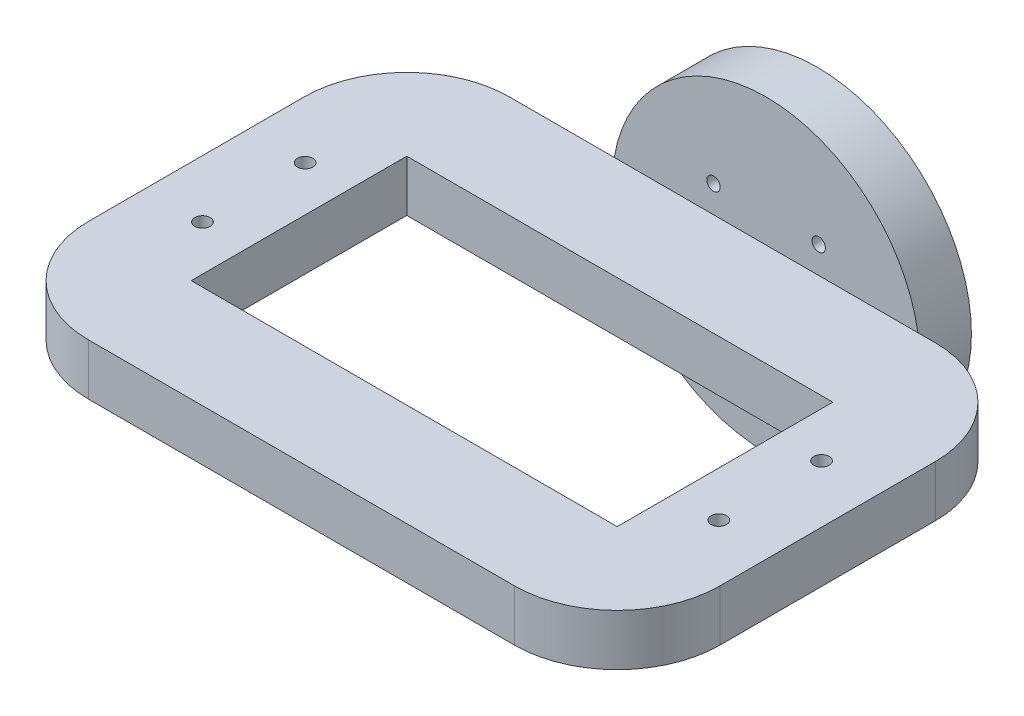
ISO-10303-21;
HEADER;
FILE_DESCRIPTION(('STEP AP214'),'2;1');
FILE_NAME('part.step','',(''),(''),'','','');
FILE_SCHEMA(('AUTOMOTIVE_DESIGN { 1 0 10303 214 1 1 1 1 }'));
ENDSEC;
DATA;
#1=APPLICATION_CONTEXT('core data for automotive mechanical design processes');
#2=APPLICATION_PROTOCOL_DEFINITION('international standard','automotive_design',2000,#1);
#3=PRODUCT_CONTEXT('',#1,'mechanical');
#4=PRODUCT('Part','Part','',(#3));
#5=PRODUCT_RELATED_PRODUCT_CATEGORY('part','',(#4));
#6=PRODUCT_DEFINITION_FORMATION('','',#4);
#7=PRODUCT_DEFINITION_CONTEXT('part definition',#1,'design');
#8=PRODUCT_DEFINITION('design','',#6,#7);
#9=PRODUCT_DEFINITION_SHAPE('','',#8);
#10=(LENGTH_UNIT() NAMED_UNIT(*) SI_UNIT(.MILLI.,.METRE.));
#11=(NAMED_UNIT(*) PLANE_ANGLE_UNIT() SI_UNIT($,.RADIAN.));
#12=(NAMED_UNIT(*) SI_UNIT($,.STERADIAN.) SOLID_ANGLE_UNIT());
#13=UNCERTAINTY_MEASURE_WITH_UNIT(LENGTH_MEASURE(1.E-05),#10,'distance_accuracy_value','');
#14=(GEOMETRIC_REPRESENTATION_CONTEXT(3) GLOBAL_UNCERTAINTY_ASSIGNED_CONTEXT((#13)) GLOBAL_UNIT_ASSIGNED_CONTEXT((#10,
#11,#12)) REPRESENTATION_CONTEXT('',''));
#15=CARTESIAN_POINT('',(0.,0.,0.));
#16=DIRECTION('',(0.,0.,1.));
#17=DIRECTION('',(1.,0.,0.));
#18=AXIS2_PLACEMENT_3D('',#15,#16,#17);
#19=CARTESIAN_POINT('',(-10.,0.,36.));
#20=DIRECTION('',(0.,-1.,0.));
#21=DIRECTION('',(1.,0.,0.));
#22=AXIS2_PLACEMENT_3D('',#19,#20,#21);
#23=CYLINDRICAL_SURFACE('',#22,10.);
#24=DIRECTION('',(0.,1.,0.));
#25=VECTOR('',#24,1.);
#26=CARTESIAN_POINT('',(-10.,0.,46.));
#27=LINE('',#26,#25);
#28=CARTESIAN_POINT('',(-10.,12.5,46.));
#29=VERTEX_POINT('',#28);
#30=CARTESIAN_POINT('',(-10.,17.5,46.));
#31=VERTEX_POINT('',#30);
#32=EDGE_CURVE('E240',#29,#31,#27,.T.);
#33=ORIENTED_EDGE('',*,*,#32,.F.);
#34=CARTESIAN_POINT('',(-10.,12.5,36.));
#35=DIRECTION('',(0.,1.,0.));
#36=DIRECTION('',(0.,0.,1.));
#37=AXIS2_PLACEMENT_3D('',#34,#35,#36);
#38=CIRCLE('',#37,10.);
#39=CARTESIAN_POINT('',(0.,12.5,36.));
#40=VERTEX_POINT('',#39);
#41=EDGE_CURVE('E48',#40,#29,#38,.F.);
#42=ORIENTED_EDGE('',*,*,#41,.F.);
#43=DIRECTION('',(0.,1.,0.));
#44=VECTOR('',#43,1.);
#45=CARTESIAN_POINT('',(0.,0.,36.));
#46=LINE('',#45,#44);
#47=CARTESIAN_POINT('',(0.,17.5,36.));
#48=VERTEX_POINT('',#47);
#49=EDGE_CURVE('E244',#48,#40,#46,.F.);
#50=ORIENTED_EDGE('',*,*,#49,.F.);
#51=CARTESIAN_POINT('',(-10.,17.5,36.));
#52=DIRECTION('',(0.,-1.,0.));
#53=DIRECTION('',(0.,0.,-1.));
#54=AXIS2_PLACEMENT_3D('',#51,#52,#53);
#55=CIRCLE('',#54,10.);
#56=EDGE_CURVE('E12',#31,#48,#55,.F.);
#57=ORIENTED_EDGE('',*,*,#56,.F.);
#58=EDGE_LOOP('',(#33,#42,#50,#57));
#59=FACE_BOUND('',#58,.T.);
#60=ADVANCED_FACE('F40',(#59),#23,.T.);
#61=CARTESIAN_POINT('',(-10.,15.,15.));
#62=DIRECTION('',(0.,1.,0.));
#63=DIRECTION('',(-1.,0.,0.));
#64=AXIS2_PLACEMENT_3D('',#61,#62,#63);
#65=CYLINDRICAL_SURFACE('',#64,10.);
#66=DIRECTION('',(0.,-1.,0.));
#67=VECTOR('',#66,1.);
#68=CARTESIAN_POINT('',(-10.,15.,5.));
#69=LINE('',#68,#67);
#70=CARTESIAN_POINT('',(-10.,17.5,5.));
#71=VERTEX_POINT('',#70);
#72=CARTESIAN_POINT('',(-10.,12.5,5.));
#73=VERTEX_POINT('',#72);
#74=EDGE_CURVE('E225',#71,#73,#69,.T.);
#75=ORIENTED_EDGE('',*,*,#74,.F.);
#76=CARTESIAN_POINT('',(-10.,17.5,15.));
#77=DIRECTION('',(0.,-1.,0.));
#78=DIRECTION('',(0.,0.,-1.));
#79=AXIS2_PLACEMENT_3D('',#76,#77,#78);
#80=CIRCLE('',#79,10.);
#81=CARTESIAN_POINT('',(0.,17.5,15.));
#82=VERTEX_POINT('',#81);
#83=EDGE_CURVE('E233',#82,#71,#80,.F.);
#84=ORIENTED_EDGE('',*,*,#83,.F.);
#85=DIRECTION('',(0.,-1.,0.));
#86=VECTOR('',#85,1.);
#87=CARTESIAN_POINT('',(0.,15.,15.));
#88=LINE('',#87,#86);
#89=CARTESIAN_POINT('',(0.,12.5,15.));
#90=VERTEX_POINT('',#89);
#91=EDGE_CURVE('E229',#90,#82,#88,.F.);
#92=ORIENTED_EDGE('',*,*,#91,.F.);
#93=CARTESIAN_POINT('',(-10.,12.5,15.));
#94=DIRECTION('',(0.,1.,0.));
#95=DIRECTION('',(0.,0.,1.));
#96=AXIS2_PLACEMENT_3D('',#93,#94,#95);
#97=CIRCLE('',#96,10.);
#98=EDGE_CURVE('E236',#73,#90,#97,.F.);
#99=ORIENTED_EDGE('',*,*,#98,.F.);
#100=EDGE_LOOP('',(#75,#84,#92,#99));
#101=FACE_BOUND('',#100,.T.);
#102=ADVANCED_FACE('F414',(#101),#65,.T.);
#103=CARTESIAN_POINT('',(-51.5,0.,36.));
#104=DIRECTION('',(0.,-1.,0.));
#105=DIRECTION('',(0.,0.,-1.));
#106=AXIS2_PLACEMENT_3D('',#103,#104,#105);
#107=CYLINDRICAL_SURFACE('',#106,10.);
#108=DIRECTION('',(0.,1.,0.));
#109=VECTOR('',#108,1.);
#110=CARTESIAN_POINT('',(-61.5,0.,36.));
#111=LINE('',#110,#109);
#112=CARTESIAN_POINT('',(-61.5,12.5,36.));
#113=VERTEX_POINT('',#112);
#114=CARTESIAN_POINT('',(-61.5,17.5,36.));
#115=VERTEX_POINT('',#114);
#116=EDGE_CURVE('E210',#113,#115,#111,.T.);
#117=ORIENTED_EDGE('',*,*,#116,.F.);
#118=CARTESIAN_POINT('',(-51.5,12.5,36.));
#119=DIRECTION('',(0.,1.,0.));
#120=DIRECTION('',(0.,0.,1.));
#121=AXIS2_PLACEMENT_3D('',#118,#119,#120);
#122=CIRCLE('',#121,10.);
#123=CARTESIAN_POINT('',(-51.5,12.5,46.));
#124=VERTEX_POINT('',#123);
#125=EDGE_CURVE('E218',#124,#113,#122,.F.);
#126=ORIENTED_EDGE('',*,*,#125,.F.);
#127=DIRECTION('',(0.,1.,0.));
#128=VECTOR('',#127,1.);
#129=CARTESIAN_POINT('',(-51.5,0.,46.));
#130=LINE('',#129,#128);
#131=CARTESIAN_POINT('',(-51.5,17.5,46.));
#132=VERTEX_POINT('',#131);
#133=EDGE_CURVE('E214',#132,#124,#130,.F.);
#134=ORIENTED_EDGE('',*,*,#133,.F.);
#135=CARTESIAN_POINT('',(-51.5,17.5,36.));
#136=DIRECTION('',(0.,-1.,0.));
#137=DIRECTION('',(0.,0.,-1.));
#138=AXIS2_PLACEMENT_3D('',#135,#136,#137);
#139=CIRCLE('',#138,10.);
#140=EDGE_CURVE('E221',#115,#132,#139,.F.);
#141=ORIENTED_EDGE('',*,*,#140,.F.);
#142=EDGE_LOOP('',(#117,#126,#134,#141));
#143=FACE_BOUND('',#142,.T.);
#144=ADVANCED_FACE('F418',(#143),#107,.T.);
#145=CARTESIAN_POINT('',(-51.5,15.,15.));
#146=DIRECTION('',(0.,-1.,0.));
#147=DIRECTION('',(0.,0.,-1.));
#148=AXIS2_PLACEMENT_3D('',#145,#146,#147);
#149=CYLINDRICAL_SURFACE('',#148,10.);
#150=DIRECTION('',(0.,1.,0.));
#151=VECTOR('',#150,1.);
#152=CARTESIAN_POINT('',(-51.5,15.,5.));
#153=LINE('',#152,#151);
#154=CARTESIAN_POINT('',(-51.5,12.5,5.));
#155=VERTEX_POINT('',#154);
#156=CARTESIAN_POINT('',(-51.5,17.5,5.));
#157=VERTEX_POINT('',#156);
#158=EDGE_CURVE('E161',#155,#157,#153,.T.);
#159=ORIENTED_EDGE('',*,*,#158,.F.);
#160=CARTESIAN_POINT('',(-51.5,12.5,15.));
#161=DIRECTION('',(0.,1.,0.));
#162=DIRECTION('',(0.,0.,1.));
#163=AXIS2_PLACEMENT_3D('',#160,#161,#162);
#164=CIRCLE('',#163,10.);
#165=CARTESIAN_POINT('',(-61.5,12.5,15.));
#166=VERTEX_POINT('',#165);
#167=EDGE_CURVE('E204',#166,#155,#164,.F.);
#168=ORIENTED_EDGE('',*,*,#167,.F.);
#169=DIRECTION('',(0.,1.,0.));
#170=VECTOR('',#169,1.);
#171=CARTESIAN_POINT('',(-61.5,15.,15.));
#172=LINE('',#171,#170);
#173=CARTESIAN_POINT('',(-61.5,17.5,15.));
#174=VERTEX_POINT('',#173);
#175=EDGE_CURVE('E200',#174,#166,#172,.F.);
#176=ORIENTED_EDGE('',*,*,#175,.F.);
#177=CARTESIAN_POINT('',(-51.5,17.5,15.));
#178=DIRECTION('',(0.,-1.,0.));
#179=DIRECTION('',(0.,0.,-1.));
#180=AXIS2_PLACEMENT_3D('',#177,#178,#179);
#181=CIRCLE('',#180,10.);
#182=EDGE_CURVE('E207',#157,#174,#181,.F.);
#183=ORIENTED_EDGE('',*,*,#182,.F.);
#184=EDGE_LOOP('',(#159,#168,#176,#183));
#185=FACE_BOUND('',#184,.T.);
#186=ADVANCED_FACE('F423',(#185),#149,.T.);
#187=CARTESIAN_POINT('',(0.,0.,46.));
#188=DIRECTION('',(0.,0.,1.));
#189=DIRECTION('',(1.,0.,0.));
#190=AXIS2_PLACEMENT_3D('',#187,#188,#189);
#191=PLANE('',#190);
#192=DIRECTION('',(1.,0.,0.));
#193=VECTOR('',#192,1.);
#194=CARTESIAN_POINT('',(-61.5,12.5,46.));
#195=LINE('',#194,#193);
#196=EDGE_CURVE('E177',#124,#29,#195,.T.);
#197=ORIENTED_EDGE('',*,*,#196,.T.);
#198=ORIENTED_EDGE('',*,*,#32,.T.);
#199=DIRECTION('',(-1.,0.,0.));
#200=VECTOR('',#199,1.);
#201=CARTESIAN_POINT('',(-61.5,17.5,46.));
#202=LINE('',#201,#200);
#203=EDGE_CURVE('E185',#31,#132,#202,.T.);
#204=ORIENTED_EDGE('',*,*,#203,.T.);
#205=ORIENTED_EDGE('',*,*,#133,.T.);
#206=EDGE_LOOP('',(#197,#198,#204,#205));
#207=FACE_BOUND('',#206,.T.);
#208=ADVANCED_FACE('F253',(#207),#191,.T.);
#209=CARTESIAN_POINT('',(-10.,17.5,36.));
#210=DIRECTION('',(1.,0.,0.));
#211=DIRECTION('',(0.,0.,-1.));
#212=AXIS2_PLACEMENT_3D('',#209,#210,#211);
#213=PLANE('',#212);
#214=DIRECTION('',(0.,0.,1.));
#215=VECTOR('',#214,1.);
#216=CARTESIAN_POINT('',(-10.,12.5,36.));
#217=LINE('',#216,#215);
#218=CARTESIAN_POINT('',(-10.,12.5,15.));
#219=VERTEX_POINT('',#218);
#220=CARTESIAN_POINT('',(-10.,12.5,36.));
#221=VERTEX_POINT('',#220);
#222=EDGE_CURVE('E279',#219,#221,#217,.T.);
#223=ORIENTED_EDGE('',*,*,#222,.T.);
#224=DIRECTION('',(0.,-1.,0.));
#225=VECTOR('',#224,1.);
#226=CARTESIAN_POINT('',(-10.,17.5,36.));
#227=LINE('',#226,#225);
#228=CARTESIAN_POINT('',(-10.,17.5,36.));
#229=VERTEX_POINT('',#228);
#230=EDGE_CURVE('E267',#229,#221,#227,.T.);
#231=ORIENTED_EDGE('',*,*,#230,.F.);
#232=DIRECTION('',(0.,0.,1.));
#233=VECTOR('',#232,1.);
#234=CARTESIAN_POINT('',(-10.,17.5,36.));
#235=LINE('',#234,#233);
#236=CARTESIAN_POINT('',(-10.,17.5,15.));
#237=VERTEX_POINT('',#236);
#238=EDGE_CURVE('E293',#237,#229,#235,.T.);
#239=ORIENTED_EDGE('',*,*,#238,.F.);
#240=DIRECTION('',(0.,-1.,0.));
#241=VECTOR('',#240,1.);
#242=CARTESIAN_POINT('',(-10.,17.5,15.));
#243=LINE('',#242,#241);
#244=EDGE_CURVE('E263',#237,#219,#243,.T.);
#245=ORIENTED_EDGE('',*,*,#244,.T.);
#246=EDGE_LOOP('',(#223,#231,#239,#245));
#247=FACE_BOUND('',#246,.T.);
#248=ADVANCED_FACE('F447',(#247),#213,.F.);
#249=CARTESIAN_POINT('',(-51.5,17.5,15.));
#250=DIRECTION('',(0.,0.,-1.));
#251=DIRECTION('',(-1.,0.,0.));
#252=AXIS2_PLACEMENT_3D('',#249,#250,#251);
#253=PLANE('',#252);
#254=DIRECTION('',(1.,0.,0.));
#255=VECTOR('',#254,1.);
#256=CARTESIAN_POINT('',(-51.5,12.5,15.));
#257=LINE('',#256,#255);
#258=CARTESIAN_POINT('',(-51.5,12.5,15.));
#259=VERTEX_POINT('',#258);
#260=EDGE_CURVE('E283',#259,#219,#257,.T.);
#261=ORIENTED_EDGE('',*,*,#260,.T.);
#262=ORIENTED_EDGE('',*,*,#244,.F.);
#263=DIRECTION('',(1.,0.,0.));
#264=VECTOR('',#263,1.);
#265=CARTESIAN_POINT('',(-51.5,17.5,15.));
#266=LINE('',#265,#264);
#267=CARTESIAN_POINT('',(-51.5,17.5,15.));
#268=VERTEX_POINT('',#267);
#269=EDGE_CURVE('E297',#268,#237,#266,.T.);
#270=ORIENTED_EDGE('',*,*,#269,.F.);
#271=DIRECTION('',(0.,-1.,0.));
#272=VECTOR('',#271,1.);
#273=CARTESIAN_POINT('',(-51.5,17.5,15.));
#274=LINE('',#273,#272);
#275=EDGE_CURVE('E259',#268,#259,#274,.T.);
#276=ORIENTED_EDGE('',*,*,#275,.T.);
#277=EDGE_LOOP('',(#261,#262,#270,#276));
#278=FACE_BOUND('',#277,.T.);
#279=ADVANCED_FACE('F451',(#278),#253,.F.);
#280=CARTESIAN_POINT('',(-51.5,17.5,36.));
#281=DIRECTION('',(-1.,0.,0.));
#282=DIRECTION('',(0.,0.,1.));
#283=AXIS2_PLACEMENT_3D('',#280,#281,#282);
#284=PLANE('',#283);
#285=DIRECTION('',(0.,0.,-1.));
#286=VECTOR('',#285,1.);
#287=CARTESIAN_POINT('',(-51.5,12.5,36.));
#288=LINE('',#287,#286);
#289=CARTESIAN_POINT('',(-51.5,12.5,36.));
#290=VERTEX_POINT('',#289);
#291=EDGE_CURVE('E287',#290,#259,#288,.T.);
#292=ORIENTED_EDGE('',*,*,#291,.T.);
#293=ORIENTED_EDGE('',*,*,#275,.F.);
#294=DIRECTION('',(0.,0.,-1.));
#295=VECTOR('',#294,1.);
#296=CARTESIAN_POINT('',(-51.5,17.5,36.));
#297=LINE('',#296,#295);
#298=CARTESIAN_POINT('',(-51.5,17.5,36.));
#299=VERTEX_POINT('',#298);
#300=EDGE_CURVE('E278',#299,#268,#297,.T.);
#301=ORIENTED_EDGE('',*,*,#300,.F.);
#302=DIRECTION('',(0.,-1.,0.));
#303=VECTOR('',#302,1.);
#304=CARTESIAN_POINT('',(-51.5,17.5,36.));
#305=LINE('',#304,#303);
#306=EDGE_CURVE('E270',#299,#290,#305,.T.);
#307=ORIENTED_EDGE('',*,*,#306,.T.);
#308=EDGE_LOOP('',(#292,#293,#301,#307));
#309=FACE_BOUND('',#308,.T.);
#310=ADVANCED_FACE('F448',(#309),#284,.F.);
#311=CARTESIAN_POINT('',(-51.5,17.5,36.));
#312=DIRECTION('',(0.,0.,1.));
#313=DIRECTION('',(1.,0.,0.));
#314=AXIS2_PLACEMENT_3D('',#311,#312,#313);
#315=PLANE('',#314);
#316=DIRECTION('',(-1.,0.,0.));
#317=VECTOR('',#316,1.);
#318=CARTESIAN_POINT('',(-51.5,12.5,36.));
#319=LINE('',#318,#317);
#320=EDGE_CURVE('E274',#221,#290,#319,.T.);
#321=ORIENTED_EDGE('',*,*,#320,.T.);
#322=ORIENTED_EDGE('',*,*,#306,.F.);
#323=DIRECTION('',(-1.,0.,0.));
#324=VECTOR('',#323,1.);
#325=CARTESIAN_POINT('',(-51.5,17.5,36.));
#326=LINE('',#325,#324);
#327=EDGE_CURVE('E264',#229,#299,#326,.T.);
#328=ORIENTED_EDGE('',*,*,#327,.F.);
#329=ORIENTED_EDGE('',*,*,#230,.T.);
#330=EDGE_LOOP('',(#321,#322,#328,#329));
#331=FACE_BOUND('',#330,.T.);
#332=ADVANCED_FACE('F443',(#331),#315,.F.);
#333=CARTESIAN_POINT('',(-61.5,17.5,46.));
#334=DIRECTION('',(0.,-1.,0.));
#335=DIRECTION('',(0.,0.,-1.));
#336=AXIS2_PLACEMENT_3D('',#333,#334,#335);
#337=PLANE('',#336);
#338=CARTESIAN_POINT('',(-5.6,17.5,20.5));
#339=DIRECTION('',(0.,-1.,0.));
#340=DIRECTION('',(0.,0.,-1.));
#341=AXIS2_PLACEMENT_3D('',#338,#339,#340);
#342=CIRCLE('',#341,0.75);
#343=CARTESIAN_POINT('',(-5.6,17.5,19.75));
#344=VERTEX_POINT('',#343);
#345=EDGE_CURVE('E326',#344,#344,#342,.T.);
#346=ORIENTED_EDGE('',*,*,#345,.T.);
#347=EDGE_LOOP('',(#346));
#348=FACE_BOUND('',#347,.T.);
#349=CARTESIAN_POINT('',(-5.6,17.5,30.5));
#350=DIRECTION('',(0.,-1.,0.));
#351=DIRECTION('',(0.,0.,-1.));
#352=AXIS2_PLACEMENT_3D('',#349,#350,#351);
#353=CIRCLE('',#352,0.75);
#354=CARTESIAN_POINT('',(-5.6,17.5,29.75));
#355=VERTEX_POINT('',#354);
#356=EDGE_CURVE('E335',#355,#355,#353,.T.);
#357=ORIENTED_EDGE('',*,*,#356,.T.);
#358=EDGE_LOOP('',(#357));
#359=FACE_BOUND('',#358,.T.);
#360=CARTESIAN_POINT('',(-55.9,17.5,30.5));
#361=DIRECTION('',(0.,-1.,0.));
#362=DIRECTION('',(0.,0.,-1.));
#363=AXIS2_PLACEMENT_3D('',#360,#361,#362);
#364=CIRCLE('',#363,0.749999999999999);
#365=CARTESIAN_POINT('',(-55.9,17.5,29.75));
#366=VERTEX_POINT('',#365);
#367=EDGE_CURVE('E318',#366,#366,#364,.T.);
#368=ORIENTED_EDGE('',*,*,#367,.T.);
#369=EDGE_LOOP('',(#368));
#370=FACE_BOUND('',#369,.T.);
#371=CARTESIAN_POINT('',(-55.9,17.5,20.5));
#372=DIRECTION('',(0.,-1.,0.));
#373=DIRECTION('',(0.,0.,-1.));
#374=AXIS2_PLACEMENT_3D('',#371,#372,#373);
#375=CIRCLE('',#374,0.749999999999999);
#376=CARTESIAN_POINT('',(-55.9,17.5,19.75));
#377=VERTEX_POINT('',#376);
#378=EDGE_CURVE('E310',#377,#377,#375,.T.);
#379=ORIENTED_EDGE('',*,*,#378,.T.);
#380=EDGE_LOOP('',(#379));
#381=FACE_BOUND('',#380,.T.);
#382=ORIENTED_EDGE('',*,*,#327,.T.);
#383=ORIENTED_EDGE('',*,*,#300,.T.);
#384=ORIENTED_EDGE('',*,*,#269,.T.);
#385=ORIENTED_EDGE('',*,*,#238,.T.);
#386=EDGE_LOOP('',(#382,#383,#384,#385));
#387=FACE_BOUND('',#386,.T.);
#388=ORIENTED_EDGE('',*,*,#203,.F.);
#389=ORIENTED_EDGE('',*,*,#56,.T.);
#390=DIRECTION('',(0.,0.,-1.));
#391=VECTOR('',#390,1.);
#392=CARTESIAN_POINT('',(0.,17.5,46.));
#393=LINE('',#392,#391);
#394=EDGE_CURVE('E184',#48,#82,#393,.T.);
#395=ORIENTED_EDGE('',*,*,#394,.T.);
#396=ORIENTED_EDGE('',*,*,#83,.T.);
#397=DIRECTION('',(-1.,0.,0.));
#398=VECTOR('',#397,1.);
#399=CARTESIAN_POINT('',(-61.5,17.5,5.));
#400=LINE('',#399,#398);
#401=CARTESIAN_POINT('',(-11.709800542251,17.5,5.));
#402=VERTEX_POINT('',#401);
#403=EDGE_CURVE('E166',#71,#402,#400,.T.);
#404=ORIENTED_EDGE('',*,*,#403,.T.);
#405=CARTESIAN_POINT('',(-41.290199457749,17.5,5.));
#406=VERTEX_POINT('',#405);
#407=EDGE_CURVE('E142',#402,#406,#400,.T.);
#408=ORIENTED_EDGE('',*,*,#407,.T.);
#409=EDGE_CURVE('E156',#406,#157,#400,.T.);
#410=ORIENTED_EDGE('',*,*,#409,.T.);
#411=ORIENTED_EDGE('',*,*,#182,.T.);
#412=DIRECTION('',(0.,0.,-1.));
#413=VECTOR('',#412,1.);
#414=CARTESIAN_POINT('',(-61.5,17.5,46.));
#415=LINE('',#414,#413);
#416=EDGE_CURVE('E181',#115,#174,#415,.T.);
#417=ORIENTED_EDGE('',*,*,#416,.F.);
#418=ORIENTED_EDGE('',*,*,#140,.T.);
#419=EDGE_LOOP('',(#388,#389,#395,#396,#404,#408,#410,#411,#417,#418));
#420=FACE_BOUND('',#419,.T.);
#421=ADVANCED_FACE('F173',(#348,#359,#370,#381,#387,#420),#337,.F.);
#422=CARTESIAN_POINT('',(-61.5,12.5,46.));
#423=DIRECTION('',(0.,1.,0.));
#424=DIRECTION('',(0.,0.,1.));
#425=AXIS2_PLACEMENT_3D('',#422,#423,#424);
#426=PLANE('',#425);
#427=CARTESIAN_POINT('',(-5.6,12.5,20.5));
#428=DIRECTION('',(0.,-1.,0.));
#429=DIRECTION('',(0.,0.,-1.));
#430=AXIS2_PLACEMENT_3D('',#427,#428,#429);
#431=CIRCLE('',#430,0.75);
#432=CARTESIAN_POINT('',(-5.6,12.5,19.75));
#433=VERTEX_POINT('',#432);
#434=EDGE_CURVE('E322',#433,#433,#431,.T.);
#435=ORIENTED_EDGE('',*,*,#434,.F.);
#436=EDGE_LOOP('',(#435));
#437=FACE_BOUND('',#436,.T.);
#438=CARTESIAN_POINT('',(-5.6,12.5,30.5));
#439=DIRECTION('',(0.,-1.,0.));
#440=DIRECTION('',(0.,0.,-1.));
#441=AXIS2_PLACEMENT_3D('',#438,#439,#440);
#442=CIRCLE('',#441,0.75);
#443=CARTESIAN_POINT('',(-5.6,12.5,29.75));
#444=VERTEX_POINT('',#443);
#445=EDGE_CURVE('E331',#444,#444,#442,.T.);
#446=ORIENTED_EDGE('',*,*,#445,.F.);
#447=EDGE_LOOP('',(#446));
#448=FACE_BOUND('',#447,.T.);
#449=CARTESIAN_POINT('',(-55.9,12.5,30.5));
#450=DIRECTION('',(0.,-1.,0.));
#451=DIRECTION('',(0.,0.,-1.));
#452=AXIS2_PLACEMENT_3D('',#449,#450,#451);
#453=CIRCLE('',#452,0.749999999999999);
#454=CARTESIAN_POINT('',(-55.9,12.5,29.75));
#455=VERTEX_POINT('',#454);
#456=EDGE_CURVE('E339',#455,#455,#453,.T.);
#457=ORIENTED_EDGE('',*,*,#456,.F.);
#458=EDGE_LOOP('',(#457));
#459=FACE_BOUND('',#458,.T.);
#460=CARTESIAN_POINT('',(-55.9,12.5,20.5));
#461=DIRECTION('',(0.,-1.,0.));
#462=DIRECTION('',(0.,0.,-1.));
#463=AXIS2_PLACEMENT_3D('',#460,#461,#462);
#464=CIRCLE('',#463,0.749999999999999);
#465=CARTESIAN_POINT('',(-55.9,12.5,19.75));
#466=VERTEX_POINT('',#465);
#467=EDGE_CURVE('E314',#466,#466,#464,.T.);
#468=ORIENTED_EDGE('',*,*,#467,.F.);
#469=EDGE_LOOP('',(#468));
#470=FACE_BOUND('',#469,.T.);
#471=ORIENTED_EDGE('',*,*,#260,.F.);
#472=ORIENTED_EDGE('',*,*,#291,.F.);
#473=ORIENTED_EDGE('',*,*,#320,.F.);
#474=ORIENTED_EDGE('',*,*,#222,.F.);
#475=EDGE_LOOP('',(#471,#472,#473,#474));
#476=FACE_BOUND('',#475,.T.);
#477=DIRECTION('',(0.,0.,-1.));
#478=VECTOR('',#477,1.);
#479=CARTESIAN_POINT('',(0.,12.5,46.));
#480=LINE('',#479,#478);
#481=EDGE_CURVE('E188',#40,#90,#480,.T.);
#482=ORIENTED_EDGE('',*,*,#481,.F.);
#483=ORIENTED_EDGE('',*,*,#41,.T.);
#484=ORIENTED_EDGE('',*,*,#196,.F.);
#485=ORIENTED_EDGE('',*,*,#125,.T.);
#486=DIRECTION('',(0.,0.,-1.));
#487=VECTOR('',#486,1.);
#488=CARTESIAN_POINT('',(-61.5,12.5,46.));
#489=LINE('',#488,#487);
#490=EDGE_CURVE('E191',#113,#166,#489,.T.);
#491=ORIENTED_EDGE('',*,*,#490,.T.);
#492=ORIENTED_EDGE('',*,*,#167,.T.);
#493=DIRECTION('',(1.,0.,0.));
#494=VECTOR('',#493,1.);
#495=CARTESIAN_POINT('',(-61.5,12.5,5.));
#496=LINE('',#495,#494);
#497=CARTESIAN_POINT('',(-41.290199457749,12.5,5.));
#498=VERTEX_POINT('',#497);
#499=EDGE_CURVE('E164',#155,#498,#496,.T.);
#500=ORIENTED_EDGE('',*,*,#499,.T.);
#501=CARTESIAN_POINT('',(-11.709800542251,12.5,5.));
#502=VERTEX_POINT('',#501);
#503=EDGE_CURVE('E273',#498,#502,#496,.T.);
#504=ORIENTED_EDGE('',*,*,#503,.T.);
#505=DIRECTION('',(-1.,0.,0.));
#506=VECTOR('',#505,1.);
#507=CARTESIAN_POINT('',(-61.5,12.5,5.));
#508=LINE('',#507,#506);
#509=EDGE_CURVE('E148',#73,#502,#508,.T.);
#510=ORIENTED_EDGE('',*,*,#509,.F.);
#511=ORIENTED_EDGE('',*,*,#98,.T.);
#512=EDGE_LOOP('',(#482,#483,#484,#485,#491,#492,#500,#504,#510,#511));
#513=FACE_BOUND('',#512,.T.);
#514=ADVANCED_FACE('F250',(#437,#448,#459,#470,#476,#513),#426,.F.);
#515=CARTESIAN_POINT('',(0.,0.,5.));
#516=DIRECTION('',(0.,0.,1.));
#517=DIRECTION('',(1.,0.,0.));
#518=AXIS2_PLACEMENT_3D('',#515,#516,#517);
#519=PLANE('',#518);
#520=CARTESIAN_POINT('',(-21.3734758363975,9.87347583639754,5.));
#521=DIRECTION('',(0.,0.,-1.));
#522=DIRECTION('',(-1.,0.,0.));
#523=AXIS2_PLACEMENT_3D('',#520,#521,#522);
#524=CIRCLE('',#523,0.650000000000001);
#525=CARTESIAN_POINT('',(-22.0234758363975,9.87347583639754,5.));
#526=VERTEX_POINT('',#525);
#527=EDGE_CURVE('E366',#526,#526,#524,.T.);
#528=ORIENTED_EDGE('',*,*,#527,.T.);
#529=EDGE_LOOP('',(#528));
#530=FACE_BOUND('',#529,.T.);
#531=CARTESIAN_POINT('',(-31.6265241636025,9.8734758363976,5.));
#532=DIRECTION('',(0.,0.,-1.));
#533=DIRECTION('',(-1.,0.,0.));
#534=AXIS2_PLACEMENT_3D('',#531,#532,#533);
#535=CIRCLE('',#534,0.649999999999997);
#536=CARTESIAN_POINT('',(-32.2765241636025,9.8734758363976,5.));
#537=VERTEX_POINT('',#536);
#538=EDGE_CURVE('E350',#537,#537,#535,.T.);
#539=ORIENTED_EDGE('',*,*,#538,.T.);
#540=EDGE_LOOP('',(#539));
#541=FACE_BOUND('',#540,.T.);
#542=ORIENTED_EDGE('',*,*,#503,.F.);
#543=CARTESIAN_POINT('',(-26.5,15.,5.));
#544=DIRECTION('',(0.,0.,-1.));
#545=DIRECTION('',(-1.,0.,0.));
#546=AXIS2_PLACEMENT_3D('',#543,#544,#545);
#547=CIRCLE('',#546,15.);
#548=EDGE_CURVE('E170',#502,#498,#547,.T.);
#549=ORIENTED_EDGE('',*,*,#548,.F.);
#550=EDGE_LOOP('',(#542,#549));
#551=FACE_BOUND('',#550,.T.);
#552=ADVANCED_FACE('F378',(#530,#541,#551),#519,.T.);
#553=CARTESIAN_POINT('',(-61.5,0.,5.));
#554=DIRECTION('',(1.,0.,0.));
#555=DIRECTION('',(0.,0.,-1.));
#556=AXIS2_PLACEMENT_3D('',#553,#554,#555);
#557=PLANE('',#556);
#558=ORIENTED_EDGE('',*,*,#490,.F.);
#559=ORIENTED_EDGE('',*,*,#116,.T.);
#560=ORIENTED_EDGE('',*,*,#416,.T.);
#561=ORIENTED_EDGE('',*,*,#175,.T.);
#562=EDGE_LOOP('',(#558,#559,#560,#561));
#563=FACE_BOUND('',#562,.T.);
#564=ADVANCED_FACE('F433',(#563),#557,.F.);
#565=CARTESIAN_POINT('',(0.,0.,5.));
#566=DIRECTION('',(-1.,0.,0.));
#567=DIRECTION('',(0.,-1.,0.));
#568=AXIS2_PLACEMENT_3D('',#565,#566,#567);
#569=PLANE('',#568);
#570=ORIENTED_EDGE('',*,*,#394,.F.);
#571=ORIENTED_EDGE('',*,*,#49,.T.);
#572=ORIENTED_EDGE('',*,*,#481,.T.);
#573=ORIENTED_EDGE('',*,*,#91,.T.);
#574=EDGE_LOOP('',(#570,#571,#572,#573));
#575=FACE_BOUND('',#574,.T.);
#576=ADVANCED_FACE('F409',(#575),#569,.F.);
#577=CARTESIAN_POINT('',(-21.3734758363975,20.1265241636025,5.));
#578=DIRECTION('',(0.,0.,-1.));
#579=DIRECTION('',(-1.,0.,0.));
#580=AXIS2_PLACEMENT_3D('',#577,#578,#579);
#581=CIRCLE('',#580,0.650000000000001);
#582=CARTESIAN_POINT('',(-22.0234758363975,20.1265241636025,5.));
#583=VERTEX_POINT('',#582);
#584=EDGE_CURVE('E358',#583,#583,#581,.T.);
#585=ORIENTED_EDGE('',*,*,#584,.T.);
#586=EDGE_LOOP('',(#585));
#587=FACE_BOUND('',#586,.T.);
#588=CARTESIAN_POINT('',(-31.6265241636025,20.1265241636025,5.));
#589=DIRECTION('',(0.,0.,-1.));
#590=DIRECTION('',(-1.,0.,0.));
#591=AXIS2_PLACEMENT_3D('',#588,#589,#590);
#592=CIRCLE('',#591,0.649999999999997);
#593=CARTESIAN_POINT('',(-32.2765241636025,20.1265241636025,5.));
#594=VERTEX_POINT('',#593);
#595=EDGE_CURVE('E327',#594,#594,#592,.T.);
#596=ORIENTED_EDGE('',*,*,#595,.T.);
#597=EDGE_LOOP('',(#596));
#598=FACE_BOUND('',#597,.T.);
#599=ORIENTED_EDGE('',*,*,#407,.F.);
#600=EDGE_CURVE('E138',#406,#402,#547,.T.);
#601=ORIENTED_EDGE('',*,*,#600,.F.);
#602=EDGE_LOOP('',(#599,#601));
#603=FACE_BOUND('',#602,.T.);
#604=ADVANCED_FACE('F140',(#587,#598,#603),#519,.T.);
#605=CARTESIAN_POINT('',(-26.5,15.,5.));
#606=DIRECTION('',(0.,0.,-1.));
#607=DIRECTION('',(-1.,0.,0.));
#608=AXIS2_PLACEMENT_3D('',#605,#606,#607);
#609=CYLINDRICAL_SURFACE('',#608,15.);
#610=CARTESIAN_POINT('',(-26.5,15.,0.));
#611=DIRECTION('',(0.,0.,1.));
#612=DIRECTION('',(1.,0.,0.));
#613=AXIS2_PLACEMENT_3D('',#610,#611,#612);
#614=CIRCLE('',#613,15.);
#615=CARTESIAN_POINT('',(-11.5,15.,0.));
#616=VERTEX_POINT('',#615);
#617=EDGE_CURVE('E194',#616,#616,#614,.T.);
#618=ORIENTED_EDGE('',*,*,#617,.T.);
#619=EDGE_LOOP('',(#618));
#620=FACE_BOUND('',#619,.T.);
#621=EDGE_CURVE('E151',#498,#406,#547,.T.);
#622=ORIENTED_EDGE('',*,*,#621,.T.);
#623=ORIENTED_EDGE('',*,*,#600,.T.);
#624=EDGE_CURVE('E149',#402,#502,#547,.T.);
#625=ORIENTED_EDGE('',*,*,#624,.T.);
#626=ORIENTED_EDGE('',*,*,#548,.T.);
#627=EDGE_LOOP('',(#622,#623,#625,#626));
#628=FACE_BOUND('',#627,.T.);
#629=ADVANCED_FACE('F168',(#620,#628),#609,.T.);
#630=CARTESIAN_POINT('',(-30.75,15.,5.));
#631=DIRECTION('',(0.,0.,-1.));
#632=DIRECTION('',(-1.,0.,0.));
#633=AXIS2_PLACEMENT_3D('',#630,#631,#632);
#634=PLANE('',#633);
#635=ORIENTED_EDGE('',*,*,#499,.F.);
#636=ORIENTED_EDGE('',*,*,#158,.T.);
#637=ORIENTED_EDGE('',*,*,#409,.F.);
#638=ORIENTED_EDGE('',*,*,#621,.F.);
#639=EDGE_LOOP('',(#635,#636,#637,#638));
#640=FACE_BOUND('',#639,.T.);
#641=ADVANCED_FACE('F158',(#640),#634,.T.);
#642=ORIENTED_EDGE('',*,*,#403,.F.);
#643=ORIENTED_EDGE('',*,*,#74,.T.);
#644=ORIENTED_EDGE('',*,*,#509,.T.);
#645=ORIENTED_EDGE('',*,*,#624,.F.);
#646=EDGE_LOOP('',(#642,#643,#644,#645));
#647=FACE_BOUND('',#646,.T.);
#648=ADVANCED_FACE('F393',(#647),#634,.T.);
#649=CARTESIAN_POINT('',(0.,0.,0.));
#650=DIRECTION('',(0.,0.,1.));
#651=DIRECTION('',(1.,0.,0.));
#652=AXIS2_PLACEMENT_3D('',#649,#650,#651);
#653=PLANE('',#652);
#654=CARTESIAN_POINT('',(-21.3734758363975,20.1265241636025,0.));
#655=DIRECTION('',(0.,0.,-1.));
#656=DIRECTION('',(-1.,0.,0.));
#657=AXIS2_PLACEMENT_3D('',#654,#655,#656);
#658=CIRCLE('',#657,0.650000000000001);
#659=CARTESIAN_POINT('',(-22.0234758363975,20.1265241636025,0.));
#660=VERTEX_POINT('',#659);
#661=EDGE_CURVE('E354',#660,#660,#658,.T.);
#662=ORIENTED_EDGE('',*,*,#661,.F.);
#663=EDGE_LOOP('',(#662));
#664=FACE_BOUND('',#663,.T.);
#665=CARTESIAN_POINT('',(-21.3734758363975,9.87347583639754,0.));
#666=DIRECTION('',(0.,0.,-1.));
#667=DIRECTION('',(-1.,0.,0.));
#668=AXIS2_PLACEMENT_3D('',#665,#666,#667);
#669=CIRCLE('',#668,0.650000000000001);
#670=CARTESIAN_POINT('',(-22.0234758363975,9.87347583639754,0.));
#671=VERTEX_POINT('',#670);
#672=EDGE_CURVE('E362',#671,#671,#669,.T.);
#673=ORIENTED_EDGE('',*,*,#672,.F.);
#674=EDGE_LOOP('',(#673));
#675=FACE_BOUND('',#674,.T.);
#676=CARTESIAN_POINT('',(-31.6265241636025,9.8734758363976,0.));
#677=DIRECTION('',(0.,0.,-1.));
#678=DIRECTION('',(-1.,0.,0.));
#679=AXIS2_PLACEMENT_3D('',#676,#677,#678);
#680=CIRCLE('',#679,0.649999999999997);
#681=CARTESIAN_POINT('',(-32.2765241636025,9.8734758363976,0.));
#682=VERTEX_POINT('',#681);
#683=EDGE_CURVE('E370',#682,#682,#680,.T.);
#684=ORIENTED_EDGE('',*,*,#683,.F.);
#685=EDGE_LOOP('',(#684));
#686=FACE_BOUND('',#685,.T.);
#687=CARTESIAN_POINT('',(-31.6265241636025,20.1265241636025,0.));
#688=DIRECTION('',(0.,0.,-1.));
#689=DIRECTION('',(-1.,0.,0.));
#690=AXIS2_PLACEMENT_3D('',#687,#688,#689);
#691=CIRCLE('',#690,0.649999999999997);
#692=CARTESIAN_POINT('',(-32.2765241636025,20.1265241636025,0.));
#693=VERTEX_POINT('',#692);
#694=EDGE_CURVE('E346',#693,#693,#691,.T.);
#695=ORIENTED_EDGE('',*,*,#694,.F.);
#696=EDGE_LOOP('',(#695));
#697=FACE_BOUND('',#696,.T.);
#698=CARTESIAN_POINT('',(-26.5,15.,0.));
#699=DIRECTION('',(0.,0.,-1.));
#700=DIRECTION('',(-1.,0.,0.));
#701=AXIS2_PLACEMENT_3D('',#698,#699,#700);
#702=CIRCLE('',#701,3.25);
#703=CARTESIAN_POINT('',(-29.75,15.,0.));
#704=VERTEX_POINT('',#703);
#705=EDGE_CURVE('E306',#704,#704,#702,.T.);
#706=ORIENTED_EDGE('',*,*,#705,.F.);
#707=EDGE_LOOP('',(#706));
#708=FACE_BOUND('',#707,.T.);
#709=ORIENTED_EDGE('',*,*,#617,.F.);
#710=EDGE_LOOP('',(#709));
#711=FACE_BOUND('',#710,.T.);
#712=ADVANCED_FACE('F389',(#664,#675,#686,#697,#708,#711),#653,.F.);
#713=CARTESIAN_POINT('',(-26.5,15.,4.));
#714=DIRECTION('',(0.,0.,-1.));
#715=DIRECTION('',(-1.,0.,0.));
#716=AXIS2_PLACEMENT_3D('',#713,#714,#715);
#717=CYLINDRICAL_SURFACE('',#716,3.25);
#718=CARTESIAN_POINT('',(-26.5,15.,4.));
#719=DIRECTION('',(0.,0.,-1.));
#720=DIRECTION('',(-1.,0.,0.));
#721=AXIS2_PLACEMENT_3D('',#718,#719,#720);
#722=CIRCLE('',#721,3.25);
#723=CARTESIAN_POINT('',(-29.75,15.,4.));
#724=VERTEX_POINT('',#723);
#725=EDGE_CURVE('E172',#724,#724,#722,.T.);
#726=ORIENTED_EDGE('',*,*,#725,.F.);
#727=EDGE_LOOP('',(#726));
#728=FACE_BOUND('',#727,.T.);
#729=ORIENTED_EDGE('',*,*,#705,.T.);
#730=EDGE_LOOP('',(#729));
#731=FACE_BOUND('',#730,.T.);
#732=ADVANCED_FACE('F392',(#728,#731),#717,.F.);
#733=CARTESIAN_POINT('',(-26.5,15.,4.));
#734=DIRECTION('',(0.,0.,-1.));
#735=DIRECTION('',(-1.,0.,0.));
#736=AXIS2_PLACEMENT_3D('',#733,#734,#735);
#737=PLANE('',#736);
#738=ORIENTED_EDGE('',*,*,#725,.T.);
#739=EDGE_LOOP('',(#738));
#740=FACE_BOUND('',#739,.T.);
#741=ADVANCED_FACE('F575',(#740),#737,.T.);
#742=CARTESIAN_POINT('',(-55.9,17.5,20.5));
#743=DIRECTION('',(0.,-1.,0.));
#744=DIRECTION('',(0.,0.,-1.));
#745=AXIS2_PLACEMENT_3D('',#742,#743,#744);
#746=CYLINDRICAL_SURFACE('',#745,0.749999999999999);
#747=ORIENTED_EDGE('',*,*,#378,.F.);
#748=EDGE_LOOP('',(#747));
#749=FACE_BOUND('',#748,.T.);
#750=ORIENTED_EDGE('',*,*,#467,.T.);
#751=EDGE_LOOP('',(#750));
#752=FACE_BOUND('',#751,.T.);
#753=ADVANCED_FACE('F566',(#749,#752),#746,.F.);
#754=CARTESIAN_POINT('',(-55.9,17.5,30.5));
#755=DIRECTION('',(0.,-1.,0.));
#756=DIRECTION('',(0.,0.,-1.));
#757=AXIS2_PLACEMENT_3D('',#754,#755,#756);
#758=CYLINDRICAL_SURFACE('',#757,0.749999999999999);
#759=ORIENTED_EDGE('',*,*,#367,.F.);
#760=EDGE_LOOP('',(#759));
#761=FACE_BOUND('',#760,.T.);
#762=ORIENTED_EDGE('',*,*,#456,.T.);
#763=EDGE_LOOP('',(#762));
#764=FACE_BOUND('',#763,.T.);
#765=ADVANCED_FACE('F562',(#761,#764),#758,.F.);
#766=CARTESIAN_POINT('',(-5.6,17.5,30.5));
#767=DIRECTION('',(0.,-1.,0.));
#768=DIRECTION('',(0.,0.,-1.));
#769=AXIS2_PLACEMENT_3D('',#766,#767,#768);
#770=CYLINDRICAL_SURFACE('',#769,0.75);
#771=ORIENTED_EDGE('',*,*,#356,.F.);
#772=EDGE_LOOP('',(#771));
#773=FACE_BOUND('',#772,.T.);
#774=ORIENTED_EDGE('',*,*,#445,.T.);
#775=EDGE_LOOP('',(#774));
#776=FACE_BOUND('',#775,.T.);
#777=ADVANCED_FACE('F565',(#773,#776),#770,.F.);
#778=CARTESIAN_POINT('',(-5.6,17.5,20.5));
#779=DIRECTION('',(0.,-1.,0.));
#780=DIRECTION('',(0.,0.,-1.));
#781=AXIS2_PLACEMENT_3D('',#778,#779,#780);
#782=CYLINDRICAL_SURFACE('',#781,0.75);
#783=ORIENTED_EDGE('',*,*,#345,.F.);
#784=EDGE_LOOP('',(#783));
#785=FACE_BOUND('',#784,.T.);
#786=ORIENTED_EDGE('',*,*,#434,.T.);
#787=EDGE_LOOP('',(#786));
#788=FACE_BOUND('',#787,.T.);
#789=ADVANCED_FACE('F527',(#785,#788),#782,.F.);
#790=CARTESIAN_POINT('',(-31.6265241636025,20.1265241636025,5.));
#791=DIRECTION('',(0.,0.,-1.));
#792=DIRECTION('',(-1.,0.,0.));
#793=AXIS2_PLACEMENT_3D('',#790,#791,#792);
#794=CYLINDRICAL_SURFACE('',#793,0.649999999999997);
#795=ORIENTED_EDGE('',*,*,#595,.F.);
#796=EDGE_LOOP('',(#795));
#797=FACE_BOUND('',#796,.T.);
#798=ORIENTED_EDGE('',*,*,#694,.T.);
#799=EDGE_LOOP('',(#798));
#800=FACE_BOUND('',#799,.T.);
#801=ADVANCED_FACE('F385',(#797,#800),#794,.F.);
#802=CARTESIAN_POINT('',(-31.6265241636025,9.8734758363976,5.));
#803=DIRECTION('',(0.,0.,-1.));
#804=DIRECTION('',(-1.,0.,0.));
#805=AXIS2_PLACEMENT_3D('',#802,#803,#804);
#806=CYLINDRICAL_SURFACE('',#805,0.649999999999997);
#807=ORIENTED_EDGE('',*,*,#538,.F.);
#808=EDGE_LOOP('',(#807));
#809=FACE_BOUND('',#808,.T.);
#810=ORIENTED_EDGE('',*,*,#683,.T.);
#811=EDGE_LOOP('',(#810));
#812=FACE_BOUND('',#811,.T.);
#813=ADVANCED_FACE('F381',(#809,#812),#806,.F.);
#814=CARTESIAN_POINT('',(-21.3734758363975,9.87347583639754,5.));
#815=DIRECTION('',(0.,0.,-1.));
#816=DIRECTION('',(-1.,0.,0.));
#817=AXIS2_PLACEMENT_3D('',#814,#815,#816);
#818=CYLINDRICAL_SURFACE('',#817,0.650000000000001);
#819=ORIENTED_EDGE('',*,*,#527,.F.);
#820=EDGE_LOOP('',(#819));
#821=FACE_BOUND('',#820,.T.);
#822=ORIENTED_EDGE('',*,*,#672,.T.);
#823=EDGE_LOOP('',(#822));
#824=FACE_BOUND('',#823,.T.);
#825=ADVANCED_FACE('F384',(#821,#824),#818,.F.);
#826=CARTESIAN_POINT('',(-21.3734758363975,20.1265241636025,5.));
#827=DIRECTION('',(0.,0.,-1.));
#828=DIRECTION('',(-1.,0.,0.));
#829=AXIS2_PLACEMENT_3D('',#826,#827,#828);
#830=CYLINDRICAL_SURFACE('',#829,0.650000000000001);
#831=ORIENTED_EDGE('',*,*,#584,.F.);
#832=EDGE_LOOP('',(#831));
#833=FACE_BOUND('',#832,.T.);
#834=ORIENTED_EDGE('',*,*,#661,.T.);
#835=EDGE_LOOP('',(#834));
#836=FACE_BOUND('',#835,.T.);
#837=ADVANCED_FACE('F545',(#833,#836),#830,.F.);
#838=CLOSED_SHELL('',(#60,#102,#144,#186,#208,#248,#279,#310,#332,#421,#514,#552,#564,#576,#604,
#629,#641,#648,#712,#732,#741,#753,#765,#777,#789,#801,#813,#825,#837));
#839=MANIFOLD_SOLID_BREP('B2',#838);
#840=ADVANCED_BREP_SHAPE_REPRESENTATION('',(#18,#839),#14);
#841=SHAPE_DEFINITION_REPRESENTATION(#9,#840);
ENDSEC;
END-ISO-10303-21;
